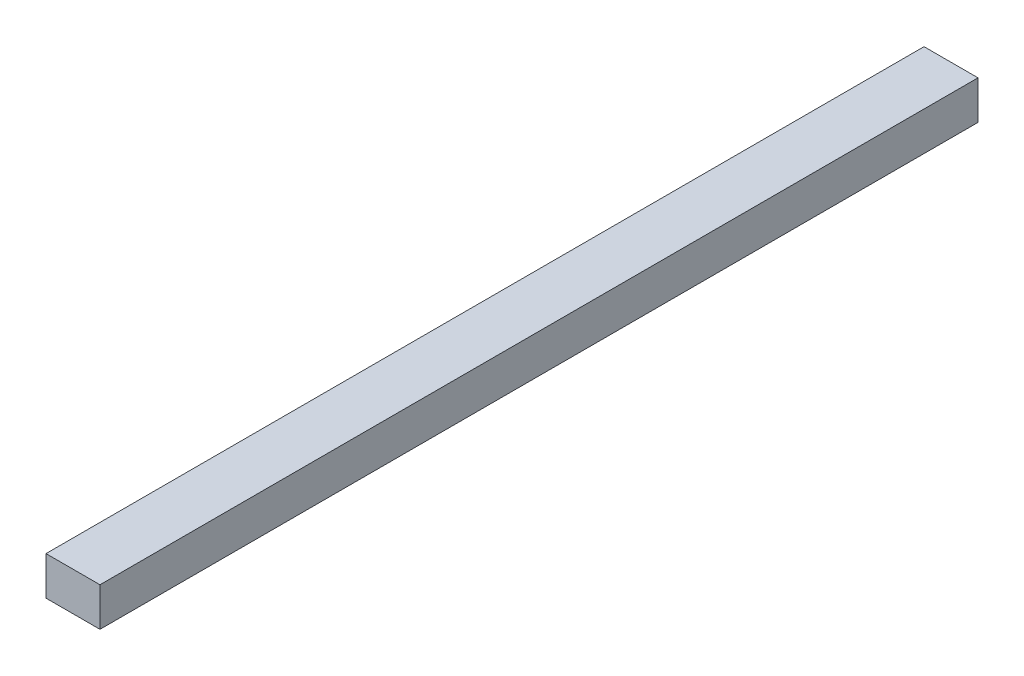
ISO-10303-21;
HEADER;
FILE_DESCRIPTION(('STEP AP214'),'2;1');
FILE_NAME('part.step','',(''),(''),'','','');
FILE_SCHEMA(('AUTOMOTIVE_DESIGN { 1 0 10303 214 1 1 1 1 }'));
ENDSEC;
DATA;
#1=APPLICATION_CONTEXT('core data for automotive mechanical design processes');
#2=APPLICATION_PROTOCOL_DEFINITION('international standard','automotive_design',2000,#1);
#3=PRODUCT_CONTEXT('',#1,'mechanical');
#4=PRODUCT('Part','Part','',(#3));
#5=PRODUCT_RELATED_PRODUCT_CATEGORY('part','',(#4));
#6=PRODUCT_DEFINITION_FORMATION('','',#4);
#7=PRODUCT_DEFINITION_CONTEXT('part definition',#1,'design');
#8=PRODUCT_DEFINITION('design','',#6,#7);
#9=PRODUCT_DEFINITION_SHAPE('','',#8);
#10=(LENGTH_UNIT() NAMED_UNIT(*) SI_UNIT(.MILLI.,.METRE.));
#11=(NAMED_UNIT(*) PLANE_ANGLE_UNIT() SI_UNIT($,.RADIAN.));
#12=(NAMED_UNIT(*) SI_UNIT($,.STERADIAN.) SOLID_ANGLE_UNIT());
#13=UNCERTAINTY_MEASURE_WITH_UNIT(LENGTH_MEASURE(1.E-05),#10,'distance_accuracy_value','');
#14=(GEOMETRIC_REPRESENTATION_CONTEXT(3) GLOBAL_UNCERTAINTY_ASSIGNED_CONTEXT((#13)) GLOBAL_UNIT_ASSIGNED_CONTEXT((#10,
#11,#12)) REPRESENTATION_CONTEXT('',''));
#15=CARTESIAN_POINT('',(0.,0.,0.));
#16=DIRECTION('',(0.,0.,1.));
#17=DIRECTION('',(1.,0.,0.));
#18=AXIS2_PLACEMENT_3D('',#15,#16,#17);
#19=CARTESIAN_POINT('',(1.4254546527396,0.0405011497279742,0.));
#20=DIRECTION('',(-1.,0.,0.));
#21=DIRECTION('',(0.,-1.,0.));
#22=AXIS2_PLACEMENT_3D('',#19,#20,#21);
#23=PLANE('',#22);
#24=DIRECTION('',(0.,-1.,0.));
#25=VECTOR('',#24,1.);
#26=CARTESIAN_POINT('',(1.4254546527396,0.0405011497279742,0.));
#27=LINE('',#26,#25);
#28=CARTESIAN_POINT('',(1.4254546527396,0.0405011497279742,0.));
#29=VERTEX_POINT('',#28);
#30=CARTESIAN_POINT('',(1.4254546527396,0.0361025279689742,0.));
#31=VERTEX_POINT('',#30);
#32=EDGE_CURVE('E11',#29,#31,#27,.T.);
#33=ORIENTED_EDGE('',*,*,#32,.T.);
#34=DIRECTION('',(0.,0.,1.));
#35=VECTOR('',#34,1.);
#36=CARTESIAN_POINT('',(1.4254546527396,0.0361025279689742,0.));
#37=LINE('',#36,#35);
#38=CARTESIAN_POINT('',(1.4254546527396,0.0361025279689742,0.1));
#39=VERTEX_POINT('',#38);
#40=EDGE_CURVE('E24',#31,#39,#37,.T.);
#41=ORIENTED_EDGE('',*,*,#40,.T.);
#42=DIRECTION('',(0.,-1.,0.));
#43=VECTOR('',#42,1.);
#44=CARTESIAN_POINT('',(1.4254546527396,0.0405011497279742,0.1));
#45=LINE('',#44,#43);
#46=CARTESIAN_POINT('',(1.4254546527396,0.0405011497279742,0.1));
#47=VERTEX_POINT('',#46);
#48=EDGE_CURVE('E75',#47,#39,#45,.T.);
#49=ORIENTED_EDGE('',*,*,#48,.F.);
#50=DIRECTION('',(0.,0.,1.));
#51=VECTOR('',#50,1.);
#52=CARTESIAN_POINT('',(1.4254546527396,0.0405011497279742,0.));
#53=LINE('',#52,#51);
#54=EDGE_CURVE('E86',#29,#47,#53,.T.);
#55=ORIENTED_EDGE('',*,*,#54,.F.);
#56=EDGE_LOOP('',(#33,#41,#49,#55));
#57=FACE_BOUND('',#56,.T.);
#58=ADVANCED_FACE('F17',(#57),#23,.T.);
#59=CARTESIAN_POINT('',(1.4316017000509,0.0405011497279742,0.));
#60=DIRECTION('',(0.,1.,0.));
#61=DIRECTION('',(-1.,0.,0.));
#62=AXIS2_PLACEMENT_3D('',#59,#60,#61);
#63=PLANE('',#62);
#64=DIRECTION('',(-1.,0.,0.));
#65=VECTOR('',#64,1.);
#66=CARTESIAN_POINT('',(1.4316017000509,0.0405011497279742,0.));
#67=LINE('',#66,#65);
#68=CARTESIAN_POINT('',(1.4316017000509,0.0405011497279742,0.));
#69=VERTEX_POINT('',#68);
#70=EDGE_CURVE('E83',#69,#29,#67,.T.);
#71=ORIENTED_EDGE('',*,*,#70,.T.);
#72=ORIENTED_EDGE('',*,*,#54,.T.);
#73=DIRECTION('',(-1.,0.,0.));
#74=VECTOR('',#73,1.);
#75=CARTESIAN_POINT('',(1.4316017000509,0.0405011497279742,0.1));
#76=LINE('',#75,#74);
#77=CARTESIAN_POINT('',(1.4316017000509,0.0405011497279742,0.1));
#78=VERTEX_POINT('',#77);
#79=EDGE_CURVE('E81',#78,#47,#76,.T.);
#80=ORIENTED_EDGE('',*,*,#79,.F.);
#81=DIRECTION('',(0.,0.,1.));
#82=VECTOR('',#81,1.);
#83=CARTESIAN_POINT('',(1.4316017000509,0.0405011497279742,0.));
#84=LINE('',#83,#82);
#85=EDGE_CURVE('E61',#69,#78,#84,.T.);
#86=ORIENTED_EDGE('',*,*,#85,.F.);
#87=EDGE_LOOP('',(#71,#72,#80,#86));
#88=FACE_BOUND('',#87,.T.);
#89=ADVANCED_FACE('F91',(#88),#63,.T.);
#90=CARTESIAN_POINT('',(1.4316017000509,0.0361025279689742,0.));
#91=DIRECTION('',(1.,0.,0.));
#92=DIRECTION('',(0.,1.,0.));
#93=AXIS2_PLACEMENT_3D('',#90,#91,#92);
#94=PLANE('',#93);
#95=DIRECTION('',(0.,1.,0.));
#96=VECTOR('',#95,1.);
#97=CARTESIAN_POINT('',(1.4316017000509,0.0361025279689742,0.));
#98=LINE('',#97,#96);
#99=CARTESIAN_POINT('',(1.4316017000509,0.0361025279689742,0.));
#100=VERTEX_POINT('',#99);
#101=EDGE_CURVE('E65',#100,#69,#98,.T.);
#102=ORIENTED_EDGE('',*,*,#101,.T.);
#103=ORIENTED_EDGE('',*,*,#85,.T.);
#104=DIRECTION('',(0.,1.,0.));
#105=VECTOR('',#104,1.);
#106=CARTESIAN_POINT('',(1.4316017000509,0.0361025279689742,0.1));
#107=LINE('',#106,#105);
#108=CARTESIAN_POINT('',(1.4316017000509,0.0361025279689742,0.1));
#109=VERTEX_POINT('',#108);
#110=EDGE_CURVE('E54',#109,#78,#107,.T.);
#111=ORIENTED_EDGE('',*,*,#110,.F.);
#112=DIRECTION('',(0.,0.,1.));
#113=VECTOR('',#112,1.);
#114=CARTESIAN_POINT('',(1.4316017000509,0.0361025279689742,0.));
#115=LINE('',#114,#113);
#116=EDGE_CURVE('E58',#100,#109,#115,.T.);
#117=ORIENTED_EDGE('',*,*,#116,.F.);
#118=EDGE_LOOP('',(#102,#103,#111,#117));
#119=FACE_BOUND('',#118,.T.);
#120=ADVANCED_FACE('F57',(#119),#94,.T.);
#121=CARTESIAN_POINT('',(1.4254546527396,0.0361025279689742,0.));
#122=DIRECTION('',(0.,-1.,0.));
#123=DIRECTION('',(1.,0.,0.));
#124=AXIS2_PLACEMENT_3D('',#121,#122,#123);
#125=PLANE('',#124);
#126=DIRECTION('',(1.,0.,0.));
#127=VECTOR('',#126,1.);
#128=CARTESIAN_POINT('',(1.4254546527396,0.0361025279689742,0.));
#129=LINE('',#128,#127);
#130=EDGE_CURVE('E71',#31,#100,#129,.T.);
#131=ORIENTED_EDGE('',*,*,#130,.T.);
#132=ORIENTED_EDGE('',*,*,#116,.T.);
#133=DIRECTION('',(1.,0.,0.));
#134=VECTOR('',#133,1.);
#135=CARTESIAN_POINT('',(1.4254546527396,0.0361025279689742,0.1));
#136=LINE('',#135,#134);
#137=EDGE_CURVE('E70',#39,#109,#136,.T.);
#138=ORIENTED_EDGE('',*,*,#137,.F.);
#139=ORIENTED_EDGE('',*,*,#40,.F.);
#140=EDGE_LOOP('',(#131,#132,#138,#139));
#141=FACE_BOUND('',#140,.T.);
#142=ADVANCED_FACE('F69',(#141),#125,.T.);
#143=CARTESIAN_POINT('',(1.4285281763953,0.0383018388484742,0.1));
#144=DIRECTION('',(0.,0.,1.));
#145=DIRECTION('',(1.,0.,0.));
#146=AXIS2_PLACEMENT_3D('',#143,#144,#145);
#147=PLANE('',#146);
#148=ORIENTED_EDGE('',*,*,#137,.T.);
#149=ORIENTED_EDGE('',*,*,#110,.T.);
#150=ORIENTED_EDGE('',*,*,#79,.T.);
#151=ORIENTED_EDGE('',*,*,#48,.T.);
#152=EDGE_LOOP('',(#148,#149,#150,#151));
#153=FACE_BOUND('',#152,.T.);
#154=ADVANCED_FACE('F74',(#153),#147,.T.);
#155=CARTESIAN_POINT('',(1.4285281763953,0.0383018388484742,0.));
#156=DIRECTION('',(0.,0.,1.));
#157=DIRECTION('',(1.,0.,0.));
#158=AXIS2_PLACEMENT_3D('',#155,#156,#157);
#159=PLANE('',#158);
#160=ORIENTED_EDGE('',*,*,#130,.F.);
#161=ORIENTED_EDGE('',*,*,#32,.F.);
#162=ORIENTED_EDGE('',*,*,#70,.F.);
#163=ORIENTED_EDGE('',*,*,#101,.F.);
#164=EDGE_LOOP('',(#160,#161,#162,#163));
#165=FACE_BOUND('',#164,.T.);
#166=ADVANCED_FACE('F89',(#165),#159,.F.);
#167=CLOSED_SHELL('',(#58,#89,#120,#142,#154,#166));
#168=MANIFOLD_SOLID_BREP('B1',#167);
#169=ADVANCED_BREP_SHAPE_REPRESENTATION('',(#18,#168),#14);
#170=SHAPE_DEFINITION_REPRESENTATION(#9,#169);
ENDSEC;
END-ISO-10303-21;
